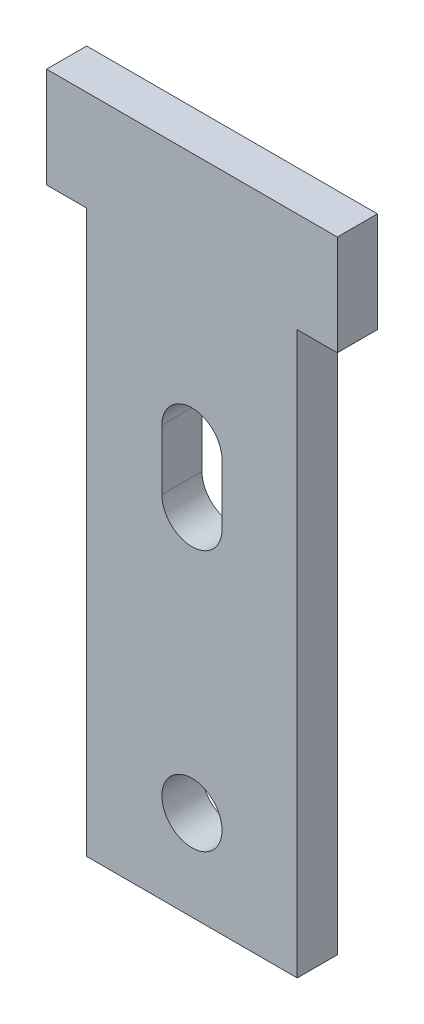
ISO-10303-21;
HEADER;
FILE_DESCRIPTION(('STEP AP214'),'2;1');
FILE_NAME('part.step','',(''),(''),'','','');
FILE_SCHEMA(('AUTOMOTIVE_DESIGN { 1 0 10303 214 1 1 1 1 }'));
ENDSEC;
DATA;
#1=APPLICATION_CONTEXT('core data for automotive mechanical design processes');
#2=APPLICATION_PROTOCOL_DEFINITION('international standard','automotive_design',2000,#1);
#3=PRODUCT_CONTEXT('',#1,'mechanical');
#4=PRODUCT('Part','Part','',(#3));
#5=PRODUCT_RELATED_PRODUCT_CATEGORY('part','',(#4));
#6=PRODUCT_DEFINITION_FORMATION('','',#4);
#7=PRODUCT_DEFINITION_CONTEXT('part definition',#1,'design');
#8=PRODUCT_DEFINITION('design','',#6,#7);
#9=PRODUCT_DEFINITION_SHAPE('','',#8);
#10=(LENGTH_UNIT() NAMED_UNIT(*) SI_UNIT(.MILLI.,.METRE.));
#11=(NAMED_UNIT(*) PLANE_ANGLE_UNIT() SI_UNIT($,.RADIAN.));
#12=(NAMED_UNIT(*) SI_UNIT($,.STERADIAN.) SOLID_ANGLE_UNIT());
#13=UNCERTAINTY_MEASURE_WITH_UNIT(LENGTH_MEASURE(1.E-05),#10,'distance_accuracy_value','');
#14=(GEOMETRIC_REPRESENTATION_CONTEXT(3) GLOBAL_UNCERTAINTY_ASSIGNED_CONTEXT((#13)) GLOBAL_UNIT_ASSIGNED_CONTEXT((#10,
#11,#12)) REPRESENTATION_CONTEXT('',''));
#15=CARTESIAN_POINT('',(0.,0.,0.));
#16=DIRECTION('',(0.,0.,1.));
#17=DIRECTION('',(1.,0.,0.));
#18=AXIS2_PLACEMENT_3D('',#15,#16,#17);
#19=CARTESIAN_POINT('',(6.6675,35.56,1.27));
#20=DIRECTION('',(-1.,0.,0.));
#21=DIRECTION('',(0.,0.,1.));
#22=AXIS2_PLACEMENT_3D('',#19,#20,#21);
#23=PLANE('',#22);
#24=DIRECTION('',(0.,0.,-1.));
#25=VECTOR('',#24,1.);
#26=CARTESIAN_POINT('',(6.6675,0.,1.27));
#27=LINE('',#26,#25);
#28=CARTESIAN_POINT('',(6.6675,0.,1.27));
#29=VERTEX_POINT('',#28);
#30=CARTESIAN_POINT('',(6.6675,0.,-1.27));
#31=VERTEX_POINT('',#30);
#32=EDGE_CURVE('E191',#29,#31,#27,.T.);
#33=ORIENTED_EDGE('',*,*,#32,.T.);
#34=DIRECTION('',(0.,-1.,0.));
#35=VECTOR('',#34,1.);
#36=CARTESIAN_POINT('',(6.6675,35.56,-1.27));
#37=LINE('',#36,#35);
#38=CARTESIAN_POINT('',(6.6675,35.56,-1.27));
#39=VERTEX_POINT('',#38);
#40=EDGE_CURVE('E11',#39,#31,#37,.T.);
#41=ORIENTED_EDGE('',*,*,#40,.F.);
#42=DIRECTION('',(0.,0.,-1.));
#43=VECTOR('',#42,1.);
#44=CARTESIAN_POINT('',(6.6675,35.56,1.27));
#45=LINE('',#44,#43);
#46=CARTESIAN_POINT('',(6.6675,35.56,1.27));
#47=VERTEX_POINT('',#46);
#48=EDGE_CURVE('E227',#47,#39,#45,.T.);
#49=ORIENTED_EDGE('',*,*,#48,.F.);
#50=DIRECTION('',(0.,-1.,0.));
#51=VECTOR('',#50,1.);
#52=CARTESIAN_POINT('',(6.6675,35.56,1.27));
#53=LINE('',#52,#51);
#54=EDGE_CURVE('E236',#47,#29,#53,.T.);
#55=ORIENTED_EDGE('',*,*,#54,.T.);
#56=EDGE_LOOP('',(#33,#41,#49,#55));
#57=FACE_BOUND('',#56,.T.);
#58=ADVANCED_FACE('F41',(#57),#23,.F.);
#59=CARTESIAN_POINT('',(-6.6675,35.56,-1.27));
#60=DIRECTION('',(0.,0.,1.));
#61=DIRECTION('',(1.,0.,0.));
#62=AXIS2_PLACEMENT_3D('',#59,#60,#61);
#63=PLANE('',#62);
#64=CARTESIAN_POINT('',(0.,5.715,-1.27));
#65=DIRECTION('',(0.,0.,1.));
#66=DIRECTION('',(1.,0.,0.));
#67=AXIS2_PLACEMENT_3D('',#64,#65,#66);
#68=CIRCLE('',#67,1.905);
#69=CARTESIAN_POINT('',(1.905,5.715,-1.27));
#70=VERTEX_POINT('',#69);
#71=EDGE_CURVE('E197',#70,#70,#68,.F.);
#72=ORIENTED_EDGE('',*,*,#71,.F.);
#73=EDGE_LOOP('',(#72));
#74=FACE_BOUND('',#73,.T.);
#75=DIRECTION('',(0.,-1.,0.));
#76=VECTOR('',#75,1.);
#77=CARTESIAN_POINT('',(1.905,26.035,-1.27));
#78=LINE('',#77,#76);
#79=CARTESIAN_POINT('',(1.905,26.035,-1.27));
#80=VERTEX_POINT('',#79);
#81=CARTESIAN_POINT('',(1.905,22.225,-1.27));
#82=VERTEX_POINT('',#81);
#83=EDGE_CURVE('E152',#80,#82,#78,.T.);
#84=ORIENTED_EDGE('',*,*,#83,.F.);
#85=CARTESIAN_POINT('',(0.,26.035,-1.27));
#86=DIRECTION('',(0.,0.,1.));
#87=DIRECTION('',(1.,0.,0.));
#88=AXIS2_PLACEMENT_3D('',#85,#86,#87);
#89=CIRCLE('',#88,1.905);
#90=CARTESIAN_POINT('',(-1.905,26.035,-1.27));
#91=VERTEX_POINT('',#90);
#92=EDGE_CURVE('E132',#91,#80,#89,.F.);
#93=ORIENTED_EDGE('',*,*,#92,.F.);
#94=DIRECTION('',(0.,1.,0.));
#95=VECTOR('',#94,1.);
#96=CARTESIAN_POINT('',(-1.905,26.035,-1.27));
#97=LINE('',#96,#95);
#98=CARTESIAN_POINT('',(-1.905,22.225,-1.27));
#99=VERTEX_POINT('',#98);
#100=EDGE_CURVE('E142',#99,#91,#97,.T.);
#101=ORIENTED_EDGE('',*,*,#100,.F.);
#102=CARTESIAN_POINT('',(0.,22.225,-1.27));
#103=DIRECTION('',(0.,0.,1.));
#104=DIRECTION('',(1.,0.,0.));
#105=AXIS2_PLACEMENT_3D('',#102,#103,#104);
#106=CIRCLE('',#105,1.905);
#107=EDGE_CURVE('E56',#82,#99,#106,.F.);
#108=ORIENTED_EDGE('',*,*,#107,.F.);
#109=EDGE_LOOP('',(#84,#93,#101,#108));
#110=FACE_BOUND('',#109,.T.);
#111=DIRECTION('',(-1.,0.,0.));
#112=VECTOR('',#111,1.);
#113=CARTESIAN_POINT('',(-6.6675,0.,-1.27));
#114=LINE('',#113,#112);
#115=CARTESIAN_POINT('',(-6.6675,0.,-1.27));
#116=VERTEX_POINT('',#115);
#117=EDGE_CURVE('E240',#31,#116,#114,.T.);
#118=ORIENTED_EDGE('',*,*,#117,.T.);
#119=DIRECTION('',(0.,-1.,0.));
#120=VECTOR('',#119,1.);
#121=CARTESIAN_POINT('',(-6.6675,35.56,-1.27));
#122=LINE('',#121,#120);
#123=CARTESIAN_POINT('',(-6.6675,35.56,-1.27));
#124=VERTEX_POINT('',#123);
#125=EDGE_CURVE('E49',#124,#116,#122,.T.);
#126=ORIENTED_EDGE('',*,*,#125,.F.);
#127=DIRECTION('',(1.,0.,0.));
#128=VECTOR('',#127,1.);
#129=CARTESIAN_POINT('',(0.,35.56,-1.27));
#130=LINE('',#129,#128);
#131=CARTESIAN_POINT('',(-9.2075,35.56,-1.27));
#132=VERTEX_POINT('',#131);
#133=EDGE_CURVE('E178',#132,#124,#130,.T.);
#134=ORIENTED_EDGE('',*,*,#133,.F.);
#135=DIRECTION('',(0.,-1.,0.));
#136=VECTOR('',#135,1.);
#137=CARTESIAN_POINT('',(-9.2075,0.,-1.27));
#138=LINE('',#137,#136);
#139=CARTESIAN_POINT('',(-9.2075,41.91,-1.27));
#140=VERTEX_POINT('',#139);
#141=EDGE_CURVE('E214',#140,#132,#138,.T.);
#142=ORIENTED_EDGE('',*,*,#141,.F.);
#143=DIRECTION('',(-1.,0.,0.));
#144=VECTOR('',#143,1.);
#145=CARTESIAN_POINT('',(0.,41.91,-1.27));
#146=LINE('',#145,#144);
#147=CARTESIAN_POINT('',(9.2075,41.91,-1.27));
#148=VERTEX_POINT('',#147);
#149=EDGE_CURVE('E187',#148,#140,#146,.T.);
#150=ORIENTED_EDGE('',*,*,#149,.F.);
#151=DIRECTION('',(0.,-1.,0.));
#152=VECTOR('',#151,1.);
#153=CARTESIAN_POINT('',(9.2075,0.,-1.27));
#154=LINE('',#153,#152);
#155=CARTESIAN_POINT('',(9.2075,35.56,-1.27));
#156=VERTEX_POINT('',#155);
#157=EDGE_CURVE('E182',#148,#156,#154,.T.);
#158=ORIENTED_EDGE('',*,*,#157,.T.);
#159=EDGE_CURVE('E183',#39,#156,#130,.T.);
#160=ORIENTED_EDGE('',*,*,#159,.F.);
#161=ORIENTED_EDGE('',*,*,#40,.T.);
#162=EDGE_LOOP('',(#118,#126,#134,#142,#150,#158,#160,#161));
#163=FACE_BOUND('',#162,.T.);
#164=ADVANCED_FACE('F149',(#74,#110,#163),#63,.F.);
#165=CARTESIAN_POINT('',(-6.6675,35.56,1.27));
#166=DIRECTION('',(1.,0.,0.));
#167=DIRECTION('',(0.,0.,-1.));
#168=AXIS2_PLACEMENT_3D('',#165,#166,#167);
#169=PLANE('',#168);
#170=DIRECTION('',(0.,0.,1.));
#171=VECTOR('',#170,1.);
#172=CARTESIAN_POINT('',(-6.6675,0.,1.27));
#173=LINE('',#172,#171);
#174=CARTESIAN_POINT('',(-6.6675,0.,1.27));
#175=VERTEX_POINT('',#174);
#176=EDGE_CURVE('E243',#116,#175,#173,.T.);
#177=ORIENTED_EDGE('',*,*,#176,.T.);
#178=DIRECTION('',(0.,-1.,0.));
#179=VECTOR('',#178,1.);
#180=CARTESIAN_POINT('',(-6.6675,35.56,1.27));
#181=LINE('',#180,#179);
#182=CARTESIAN_POINT('',(-6.6675,35.56,1.27));
#183=VERTEX_POINT('',#182);
#184=EDGE_CURVE('E251',#183,#175,#181,.T.);
#185=ORIENTED_EDGE('',*,*,#184,.F.);
#186=DIRECTION('',(0.,0.,1.));
#187=VECTOR('',#186,1.);
#188=CARTESIAN_POINT('',(-6.6675,35.56,1.27));
#189=LINE('',#188,#187);
#190=EDGE_CURVE('E231',#124,#183,#189,.T.);
#191=ORIENTED_EDGE('',*,*,#190,.F.);
#192=ORIENTED_EDGE('',*,*,#125,.T.);
#193=EDGE_LOOP('',(#177,#185,#191,#192));
#194=FACE_BOUND('',#193,.T.);
#195=ADVANCED_FACE('F259',(#194),#169,.F.);
#196=CARTESIAN_POINT('',(-6.6675,35.56,1.27));
#197=DIRECTION('',(0.,0.,-1.));
#198=DIRECTION('',(-1.,0.,0.));
#199=AXIS2_PLACEMENT_3D('',#196,#197,#198);
#200=PLANE('',#199);
#201=CARTESIAN_POINT('',(0.,5.715,1.27));
#202=DIRECTION('',(0.,0.,1.));
#203=DIRECTION('',(1.,0.,0.));
#204=AXIS2_PLACEMENT_3D('',#201,#202,#203);
#205=CIRCLE('',#204,1.905);
#206=CARTESIAN_POINT('',(1.905,5.715,1.27));
#207=VERTEX_POINT('',#206);
#208=EDGE_CURVE('E146',#207,#207,#205,.T.);
#209=ORIENTED_EDGE('',*,*,#208,.F.);
#210=EDGE_LOOP('',(#209));
#211=FACE_BOUND('',#210,.T.);
#212=DIRECTION('',(0.,-1.,0.));
#213=VECTOR('',#212,1.);
#214=CARTESIAN_POINT('',(-1.905,26.035,1.27));
#215=LINE('',#214,#213);
#216=CARTESIAN_POINT('',(-1.905,26.035,1.27));
#217=VERTEX_POINT('',#216);
#218=CARTESIAN_POINT('',(-1.905,22.225,1.27));
#219=VERTEX_POINT('',#218);
#220=EDGE_CURVE('E157',#217,#219,#215,.T.);
#221=ORIENTED_EDGE('',*,*,#220,.F.);
#222=CARTESIAN_POINT('',(0.,26.035,1.27));
#223=DIRECTION('',(0.,0.,1.));
#224=DIRECTION('',(1.,0.,0.));
#225=AXIS2_PLACEMENT_3D('',#222,#223,#224);
#226=CIRCLE('',#225,1.905);
#227=CARTESIAN_POINT('',(1.905,26.035,1.27));
#228=VERTEX_POINT('',#227);
#229=EDGE_CURVE('E64',#228,#217,#226,.T.);
#230=ORIENTED_EDGE('',*,*,#229,.F.);
#231=DIRECTION('',(0.,1.,0.));
#232=VECTOR('',#231,1.);
#233=CARTESIAN_POINT('',(1.905,26.035,1.27));
#234=LINE('',#233,#232);
#235=CARTESIAN_POINT('',(1.905,22.225,1.27));
#236=VERTEX_POINT('',#235);
#237=EDGE_CURVE('E139',#236,#228,#234,.T.);
#238=ORIENTED_EDGE('',*,*,#237,.F.);
#239=CARTESIAN_POINT('',(0.,22.225,1.27));
#240=DIRECTION('',(0.,0.,1.));
#241=DIRECTION('',(1.,0.,0.));
#242=AXIS2_PLACEMENT_3D('',#239,#240,#241);
#243=CIRCLE('',#242,1.905);
#244=EDGE_CURVE('E164',#219,#236,#243,.T.);
#245=ORIENTED_EDGE('',*,*,#244,.F.);
#246=EDGE_LOOP('',(#221,#230,#238,#245));
#247=FACE_BOUND('',#246,.T.);
#248=DIRECTION('',(1.,0.,0.));
#249=VECTOR('',#248,1.);
#250=CARTESIAN_POINT('',(-6.6675,0.,1.27));
#251=LINE('',#250,#249);
#252=EDGE_CURVE('E232',#175,#29,#251,.T.);
#253=ORIENTED_EDGE('',*,*,#252,.T.);
#254=ORIENTED_EDGE('',*,*,#54,.F.);
#255=DIRECTION('',(-1.,0.,0.));
#256=VECTOR('',#255,1.);
#257=CARTESIAN_POINT('',(0.,35.56,1.27));
#258=LINE('',#257,#256);
#259=CARTESIAN_POINT('',(9.2075,35.56,1.27));
#260=VERTEX_POINT('',#259);
#261=EDGE_CURVE('E202',#260,#47,#258,.T.);
#262=ORIENTED_EDGE('',*,*,#261,.F.);
#263=DIRECTION('',(0.,1.,0.));
#264=VECTOR('',#263,1.);
#265=CARTESIAN_POINT('',(9.2075,0.,1.27));
#266=LINE('',#265,#264);
#267=CARTESIAN_POINT('',(9.2075,41.91,1.27));
#268=VERTEX_POINT('',#267);
#269=EDGE_CURVE('E206',#260,#268,#266,.T.);
#270=ORIENTED_EDGE('',*,*,#269,.T.);
#271=DIRECTION('',(1.,0.,0.));
#272=VECTOR('',#271,1.);
#273=CARTESIAN_POINT('',(0.,41.91,1.27));
#274=LINE('',#273,#272);
#275=CARTESIAN_POINT('',(-9.2075,41.91,1.27));
#276=VERTEX_POINT('',#275);
#277=EDGE_CURVE('E192',#276,#268,#274,.T.);
#278=ORIENTED_EDGE('',*,*,#277,.F.);
#279=DIRECTION('',(0.,1.,0.));
#280=VECTOR('',#279,1.);
#281=CARTESIAN_POINT('',(-9.2075,0.,1.27));
#282=LINE('',#281,#280);
#283=CARTESIAN_POINT('',(-9.2075,35.56,1.27));
#284=VERTEX_POINT('',#283);
#285=EDGE_CURVE('E196',#284,#276,#282,.T.);
#286=ORIENTED_EDGE('',*,*,#285,.F.);
#287=EDGE_CURVE('E201',#183,#284,#258,.T.);
#288=ORIENTED_EDGE('',*,*,#287,.F.);
#289=ORIENTED_EDGE('',*,*,#184,.T.);
#290=EDGE_LOOP('',(#253,#254,#262,#270,#278,#286,#288,#289));
#291=FACE_BOUND('',#290,.T.);
#292=ADVANCED_FACE('F265',(#211,#247,#291),#200,.F.);
#293=CARTESIAN_POINT('',(0.,0.,0.));
#294=DIRECTION('',(0.,-1.,0.));
#295=DIRECTION('',(0.,0.,-1.));
#296=AXIS2_PLACEMENT_3D('',#293,#294,#295);
#297=PLANE('',#296);
#298=ORIENTED_EDGE('',*,*,#32,.F.);
#299=ORIENTED_EDGE('',*,*,#252,.F.);
#300=ORIENTED_EDGE('',*,*,#176,.F.);
#301=ORIENTED_EDGE('',*,*,#117,.F.);
#302=EDGE_LOOP('',(#298,#299,#300,#301));
#303=FACE_BOUND('',#302,.T.);
#304=ADVANCED_FACE('F263',(#303),#297,.T.);
#305=CARTESIAN_POINT('',(0.,35.56,-20.749084295726));
#306=DIRECTION('',(0.,1.,0.));
#307=DIRECTION('',(0.,0.,1.));
#308=AXIS2_PLACEMENT_3D('',#305,#306,#307);
#309=PLANE('',#308);
#310=ORIENTED_EDGE('',*,*,#261,.T.);
#311=ORIENTED_EDGE('',*,*,#48,.T.);
#312=ORIENTED_EDGE('',*,*,#159,.T.);
#313=DIRECTION('',(0.,0.,1.));
#314=VECTOR('',#313,1.);
#315=CARTESIAN_POINT('',(9.2075,35.56,-20.749084295726));
#316=LINE('',#315,#314);
#317=EDGE_CURVE('E215',#156,#260,#316,.T.);
#318=ORIENTED_EDGE('',*,*,#317,.T.);
#319=EDGE_LOOP('',(#310,#311,#312,#318));
#320=FACE_BOUND('',#319,.T.);
#321=ADVANCED_FACE('F272',(#320),#309,.F.);
#322=ORIENTED_EDGE('',*,*,#133,.T.);
#323=ORIENTED_EDGE('',*,*,#190,.T.);
#324=ORIENTED_EDGE('',*,*,#287,.T.);
#325=DIRECTION('',(0.,0.,1.));
#326=VECTOR('',#325,1.);
#327=CARTESIAN_POINT('',(-9.2075,35.56,-20.749084295726));
#328=LINE('',#327,#326);
#329=EDGE_CURVE('E218',#132,#284,#328,.T.);
#330=ORIENTED_EDGE('',*,*,#329,.F.);
#331=EDGE_LOOP('',(#322,#323,#324,#330));
#332=FACE_BOUND('',#331,.T.);
#333=ADVANCED_FACE('F288',(#332),#309,.F.);
#334=CARTESIAN_POINT('',(-9.2075,0.,-20.749084295726));
#335=DIRECTION('',(1.,0.,0.));
#336=DIRECTION('',(0.,0.,-1.));
#337=AXIS2_PLACEMENT_3D('',#334,#335,#336);
#338=PLANE('',#337);
#339=DIRECTION('',(0.,0.,1.));
#340=VECTOR('',#339,1.);
#341=CARTESIAN_POINT('',(-9.2075,41.91,-20.749084295726));
#342=LINE('',#341,#340);
#343=EDGE_CURVE('E210',#140,#276,#342,.T.);
#344=ORIENTED_EDGE('',*,*,#343,.F.);
#345=ORIENTED_EDGE('',*,*,#141,.T.);
#346=ORIENTED_EDGE('',*,*,#329,.T.);
#347=ORIENTED_EDGE('',*,*,#285,.T.);
#348=EDGE_LOOP('',(#344,#345,#346,#347));
#349=FACE_BOUND('',#348,.T.);
#350=ADVANCED_FACE('F285',(#349),#338,.F.);
#351=CARTESIAN_POINT('',(9.2075,0.,-20.749084295726));
#352=DIRECTION('',(1.,0.,0.));
#353=DIRECTION('',(0.,0.,-1.));
#354=AXIS2_PLACEMENT_3D('',#351,#352,#353);
#355=PLANE('',#354);
#356=ORIENTED_EDGE('',*,*,#157,.F.);
#357=DIRECTION('',(0.,0.,1.));
#358=VECTOR('',#357,1.);
#359=CARTESIAN_POINT('',(9.2075,41.91,-20.749084295726));
#360=LINE('',#359,#358);
#361=EDGE_CURVE('E211',#148,#268,#360,.T.);
#362=ORIENTED_EDGE('',*,*,#361,.T.);
#363=ORIENTED_EDGE('',*,*,#269,.F.);
#364=ORIENTED_EDGE('',*,*,#317,.F.);
#365=EDGE_LOOP('',(#356,#362,#363,#364));
#366=FACE_BOUND('',#365,.T.);
#367=ADVANCED_FACE('F278',(#366),#355,.T.);
#368=CARTESIAN_POINT('',(0.,41.91,-20.749084295726));
#369=DIRECTION('',(0.,-1.,0.));
#370=DIRECTION('',(0.,0.,-1.));
#371=AXIS2_PLACEMENT_3D('',#368,#369,#370);
#372=PLANE('',#371);
#373=ORIENTED_EDGE('',*,*,#361,.F.);
#374=ORIENTED_EDGE('',*,*,#149,.T.);
#375=ORIENTED_EDGE('',*,*,#343,.T.);
#376=ORIENTED_EDGE('',*,*,#277,.T.);
#377=EDGE_LOOP('',(#373,#374,#375,#376));
#378=FACE_BOUND('',#377,.T.);
#379=ADVANCED_FACE('F281',(#378),#372,.F.);
#380=CARTESIAN_POINT('',(0.,26.035,-1.271));
#381=DIRECTION('',(0.,0.,1.));
#382=DIRECTION('',(1.,0.,0.));
#383=AXIS2_PLACEMENT_3D('',#380,#381,#382);
#384=CYLINDRICAL_SURFACE('',#383,1.905);
#385=ORIENTED_EDGE('',*,*,#92,.T.);
#386=DIRECTION('',(0.,0.,1.));
#387=VECTOR('',#386,1.);
#388=CARTESIAN_POINT('',(1.905,26.035,-1.271));
#389=LINE('',#388,#387);
#390=EDGE_CURVE('E147',#80,#228,#389,.T.);
#391=ORIENTED_EDGE('',*,*,#390,.T.);
#392=ORIENTED_EDGE('',*,*,#229,.T.);
#393=DIRECTION('',(0.,0.,1.));
#394=VECTOR('',#393,1.);
#395=CARTESIAN_POINT('',(-1.905,26.035,-1.271));
#396=LINE('',#395,#394);
#397=EDGE_CURVE('E128',#91,#217,#396,.T.);
#398=ORIENTED_EDGE('',*,*,#397,.F.);
#399=EDGE_LOOP('',(#385,#391,#392,#398));
#400=FACE_BOUND('',#399,.T.);
#401=ADVANCED_FACE('F130',(#400),#384,.F.);
#402=CARTESIAN_POINT('',(1.905,26.035,-1.271));
#403=DIRECTION('',(1.,0.,0.));
#404=DIRECTION('',(0.,1.,0.));
#405=AXIS2_PLACEMENT_3D('',#402,#403,#404);
#406=PLANE('',#405);
#407=ORIENTED_EDGE('',*,*,#83,.T.);
#408=DIRECTION('',(0.,0.,1.));
#409=VECTOR('',#408,1.);
#410=CARTESIAN_POINT('',(1.905,22.225,-1.271));
#411=LINE('',#410,#409);
#412=EDGE_CURVE('E173',#82,#236,#411,.T.);
#413=ORIENTED_EDGE('',*,*,#412,.T.);
#414=ORIENTED_EDGE('',*,*,#237,.T.);
#415=ORIENTED_EDGE('',*,*,#390,.F.);
#416=EDGE_LOOP('',(#407,#413,#414,#415));
#417=FACE_BOUND('',#416,.T.);
#418=ADVANCED_FACE('F309',(#417),#406,.F.);
#419=CARTESIAN_POINT('',(0.,22.225,-1.271));
#420=DIRECTION('',(0.,0.,1.));
#421=DIRECTION('',(1.,0.,0.));
#422=AXIS2_PLACEMENT_3D('',#419,#420,#421);
#423=CYLINDRICAL_SURFACE('',#422,1.905);
#424=ORIENTED_EDGE('',*,*,#107,.T.);
#425=DIRECTION('',(0.,0.,1.));
#426=VECTOR('',#425,1.);
#427=CARTESIAN_POINT('',(-1.905,22.225,-1.271));
#428=LINE('',#427,#426);
#429=EDGE_CURVE('E138',#99,#219,#428,.T.);
#430=ORIENTED_EDGE('',*,*,#429,.T.);
#431=ORIENTED_EDGE('',*,*,#244,.T.);
#432=ORIENTED_EDGE('',*,*,#412,.F.);
#433=EDGE_LOOP('',(#424,#430,#431,#432));
#434=FACE_BOUND('',#433,.T.);
#435=ADVANCED_FACE('F307',(#434),#423,.F.);
#436=CARTESIAN_POINT('',(-1.905,26.035,-1.271));
#437=DIRECTION('',(-1.,0.,0.));
#438=DIRECTION('',(0.,-1.,0.));
#439=AXIS2_PLACEMENT_3D('',#436,#437,#438);
#440=PLANE('',#439);
#441=ORIENTED_EDGE('',*,*,#100,.T.);
#442=ORIENTED_EDGE('',*,*,#397,.T.);
#443=ORIENTED_EDGE('',*,*,#220,.T.);
#444=ORIENTED_EDGE('',*,*,#429,.F.);
#445=EDGE_LOOP('',(#441,#442,#443,#444));
#446=FACE_BOUND('',#445,.T.);
#447=ADVANCED_FACE('F143',(#446),#440,.F.);
#448=CARTESIAN_POINT('',(0.,5.715,-1.271));
#449=DIRECTION('',(0.,0.,1.));
#450=DIRECTION('',(1.,0.,0.));
#451=AXIS2_PLACEMENT_3D('',#448,#449,#450);
#452=CYLINDRICAL_SURFACE('',#451,1.905);
#453=ORIENTED_EDGE('',*,*,#208,.T.);
#454=EDGE_LOOP('',(#453));
#455=FACE_BOUND('',#454,.T.);
#456=ORIENTED_EDGE('',*,*,#71,.T.);
#457=EDGE_LOOP('',(#456));
#458=FACE_BOUND('',#457,.T.);
#459=ADVANCED_FACE('F299',(#455,#458),#452,.F.);
#460=CLOSED_SHELL('',(#58,#164,#195,#292,#304,#321,#333,#350,#367,#379,#401,#418,#435,#447,#459));
#461=MANIFOLD_SOLID_BREP('B2',#460);
#462=ADVANCED_BREP_SHAPE_REPRESENTATION('',(#18,#461),#14);
#463=SHAPE_DEFINITION_REPRESENTATION(#9,#462);
ENDSEC;
END-ISO-10303-21;
